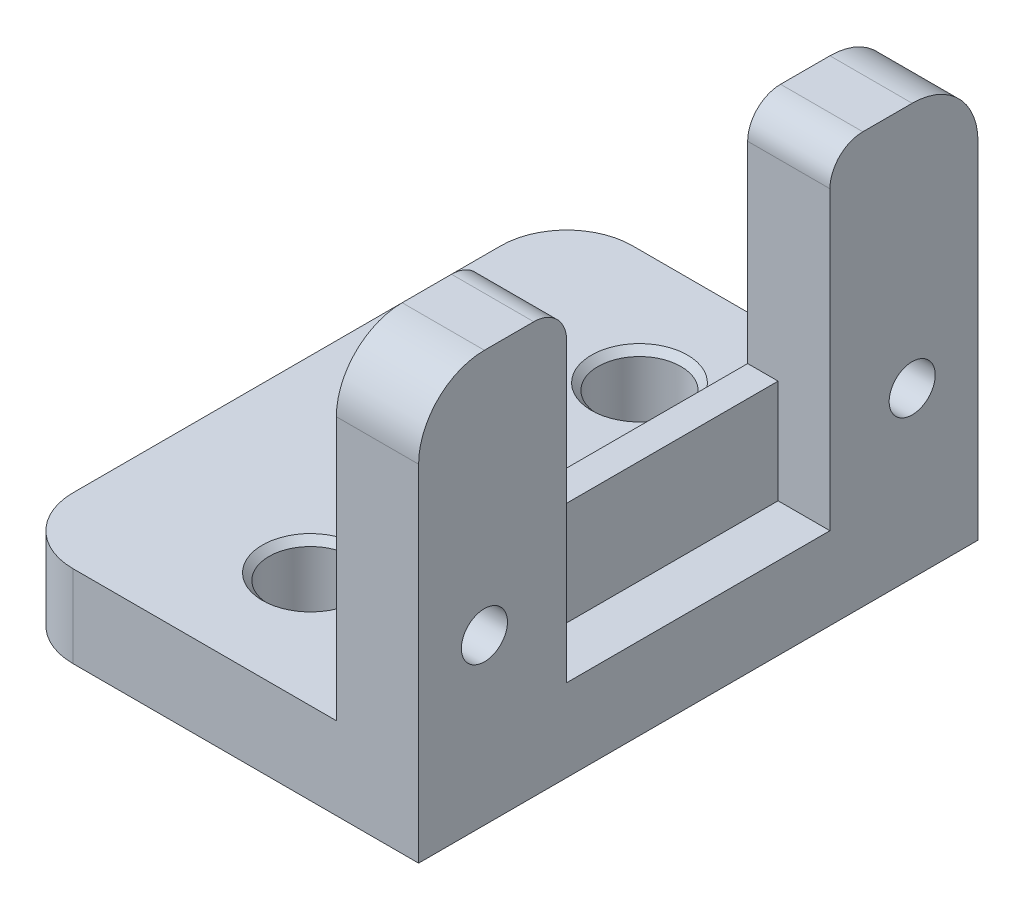
ISO-10303-21;
HEADER;
FILE_DESCRIPTION(('STEP AP214'),'2;1');
FILE_NAME('part.step','',(''),(''),'','','');
FILE_SCHEMA(('AUTOMOTIVE_DESIGN { 1 0 10303 214 1 1 1 1 }'));
ENDSEC;
DATA;
#1=APPLICATION_CONTEXT('core data for automotive mechanical design processes');
#2=APPLICATION_PROTOCOL_DEFINITION('international standard','automotive_design',2000,#1);
#3=PRODUCT_CONTEXT('',#1,'mechanical');
#4=PRODUCT('Part','Part','',(#3));
#5=PRODUCT_RELATED_PRODUCT_CATEGORY('part','',(#4));
#6=PRODUCT_DEFINITION_FORMATION('','',#4);
#7=PRODUCT_DEFINITION_CONTEXT('part definition',#1,'design');
#8=PRODUCT_DEFINITION('design','',#6,#7);
#9=PRODUCT_DEFINITION_SHAPE('','',#8);
#10=(LENGTH_UNIT() NAMED_UNIT(*) SI_UNIT(.MILLI.,.METRE.));
#11=(NAMED_UNIT(*) PLANE_ANGLE_UNIT() SI_UNIT($,.RADIAN.));
#12=(NAMED_UNIT(*) SI_UNIT($,.STERADIAN.) SOLID_ANGLE_UNIT());
#13=UNCERTAINTY_MEASURE_WITH_UNIT(LENGTH_MEASURE(1.E-05),#10,'distance_accuracy_value','');
#14=(GEOMETRIC_REPRESENTATION_CONTEXT(3) GLOBAL_UNCERTAINTY_ASSIGNED_CONTEXT((#13)) GLOBAL_UNIT_ASSIGNED_CONTEXT((#10,
#11,#12)) REPRESENTATION_CONTEXT('',''));
#15=CARTESIAN_POINT('',(0.,0.,0.));
#16=DIRECTION('',(0.,0.,1.));
#17=DIRECTION('',(1.,0.,0.));
#18=AXIS2_PLACEMENT_3D('',#15,#16,#17);
#19=CARTESIAN_POINT('',(-3.175,3.175,10.795));
#20=DIRECTION('',(0.,-1.,0.));
#21=DIRECTION('',(1.,0.,0.));
#22=AXIS2_PLACEMENT_3D('',#19,#20,#21);
#23=PLANE('',#22);
#24=CARTESIAN_POINT('',(-8.62,3.175,6.35));
#25=DIRECTION('',(0.,-1.,0.));
#26=DIRECTION('',(1.,0.,0.));
#27=AXIS2_PLACEMENT_3D('',#24,#25,#26);
#28=CIRCLE('',#27,1.85400000000001);
#29=CARTESIAN_POINT('',(-6.76599999999999,3.175,6.35));
#30=VERTEX_POINT('',#29);
#31=EDGE_CURVE('E270',#30,#30,#28,.T.);
#32=ORIENTED_EDGE('',*,*,#31,.T.);
#33=EDGE_LOOP('',(#32));
#34=FACE_BOUND('',#33,.T.);
#35=CARTESIAN_POINT('',(-8.62,3.175,-6.35));
#36=DIRECTION('',(0.,-1.,0.));
#37=DIRECTION('',(1.,0.,0.));
#38=AXIS2_PLACEMENT_3D('',#35,#36,#37);
#39=CIRCLE('',#38,1.85400000000001);
#40=CARTESIAN_POINT('',(-6.76599999999999,3.175,-6.35));
#41=VERTEX_POINT('',#40);
#42=EDGE_CURVE('E267',#41,#41,#39,.T.);
#43=ORIENTED_EDGE('',*,*,#42,.T.);
#44=EDGE_LOOP('',(#43));
#45=FACE_BOUND('',#44,.T.);
#46=DIRECTION('',(-1.,0.,0.));
#47=VECTOR('',#46,1.);
#48=CARTESIAN_POINT('',(-3.175,3.175,-10.795));
#49=LINE('',#48,#47);
#50=CARTESIAN_POINT('',(-3.175,3.175,-10.795));
#51=VERTEX_POINT('',#50);
#52=CARTESIAN_POINT('',(-13.335,3.175,-10.795));
#53=VERTEX_POINT('',#52);
#54=EDGE_CURVE('E223',#51,#53,#49,.T.);
#55=ORIENTED_EDGE('',*,*,#54,.T.);
#56=CARTESIAN_POINT('',(-13.335,3.175,-8.255));
#57=DIRECTION('',(0.,-1.,0.));
#58=DIRECTION('',(1.,0.,0.));
#59=AXIS2_PLACEMENT_3D('',#56,#57,#58);
#60=CIRCLE('',#59,2.54);
#61=CARTESIAN_POINT('',(-15.875,3.175,-8.255));
#62=VERTEX_POINT('',#61);
#63=EDGE_CURVE('E311',#53,#62,#60,.F.);
#64=ORIENTED_EDGE('',*,*,#63,.T.);
#65=DIRECTION('',(0.,0.,-1.));
#66=VECTOR('',#65,1.);
#67=CARTESIAN_POINT('',(-15.875,3.175,10.795));
#68=LINE('',#67,#66);
#69=CARTESIAN_POINT('',(-15.875,3.175,8.255));
#70=VERTEX_POINT('',#69);
#71=EDGE_CURVE('E231',#70,#62,#68,.T.);
#72=ORIENTED_EDGE('',*,*,#71,.F.);
#73=CARTESIAN_POINT('',(-13.335,3.175,8.255));
#74=DIRECTION('',(0.,-1.,0.));
#75=DIRECTION('',(1.,0.,0.));
#76=AXIS2_PLACEMENT_3D('',#73,#74,#75);
#77=CIRCLE('',#76,2.54);
#78=CARTESIAN_POINT('',(-13.335,3.175,10.795));
#79=VERTEX_POINT('',#78);
#80=EDGE_CURVE('E309',#70,#79,#77,.F.);
#81=ORIENTED_EDGE('',*,*,#80,.T.);
#82=DIRECTION('',(-1.,0.,0.));
#83=VECTOR('',#82,1.);
#84=CARTESIAN_POINT('',(-3.175,3.175,10.795));
#85=LINE('',#84,#83);
#86=CARTESIAN_POINT('',(-3.175,3.175,10.795));
#87=VERTEX_POINT('',#86);
#88=EDGE_CURVE('E228',#87,#79,#85,.T.);
#89=ORIENTED_EDGE('',*,*,#88,.F.);
#90=DIRECTION('',(0.,0.,-1.));
#91=VECTOR('',#90,1.);
#92=CARTESIAN_POINT('',(-3.175,3.175,10.795));
#93=LINE('',#92,#91);
#94=EDGE_CURVE('E244',#87,#51,#93,.T.);
#95=ORIENTED_EDGE('',*,*,#94,.T.);
#96=EDGE_LOOP('',(#55,#64,#72,#81,#89,#95));
#97=FACE_BOUND('',#96,.T.);
#98=ADVANCED_FACE('F38',(#34,#45,#97),#23,.F.);
#99=DIRECTION('',(0.,0.,-1.));
#100=VECTOR('',#99,1.);
#101=CARTESIAN_POINT('',(-2.,3.175,5.08));
#102=LINE('',#101,#100);
#103=CARTESIAN_POINT('',(-2.,3.175,5.08));
#104=VERTEX_POINT('',#103);
#105=CARTESIAN_POINT('',(-2.,3.175,-5.08));
#106=VERTEX_POINT('',#105);
#107=EDGE_CURVE('E184',#104,#106,#102,.T.);
#108=ORIENTED_EDGE('',*,*,#107,.F.);
#109=DIRECTION('',(1.,0.,0.));
#110=VECTOR('',#109,1.);
#111=CARTESIAN_POINT('',(-15.875,3.175,5.08));
#112=LINE('',#111,#110);
#113=CARTESIAN_POINT('',(0.,3.175,5.08));
#114=VERTEX_POINT('',#113);
#115=EDGE_CURVE('E214',#104,#114,#112,.T.);
#116=ORIENTED_EDGE('',*,*,#115,.T.);
#117=DIRECTION('',(0.,0.,-1.));
#118=VECTOR('',#117,1.);
#119=CARTESIAN_POINT('',(0.,3.175,5.08));
#120=LINE('',#119,#118);
#121=CARTESIAN_POINT('',(0.,3.175,-5.08));
#122=VERTEX_POINT('',#121);
#123=EDGE_CURVE('E209',#114,#122,#120,.T.);
#124=ORIENTED_EDGE('',*,*,#123,.T.);
#125=DIRECTION('',(1.,0.,0.));
#126=VECTOR('',#125,1.);
#127=CARTESIAN_POINT('',(-15.875,3.175,-5.08));
#128=LINE('',#127,#126);
#129=EDGE_CURVE('E207',#106,#122,#128,.T.);
#130=ORIENTED_EDGE('',*,*,#129,.F.);
#131=EDGE_LOOP('',(#108,#116,#124,#130));
#132=FACE_BOUND('',#131,.T.);
#133=ADVANCED_FACE('F392',(#132),#23,.F.);
#134=CARTESIAN_POINT('',(-15.875,15.875,5.08));
#135=DIRECTION('',(0.,0.,1.));
#136=DIRECTION('',(0.,-1.,0.));
#137=AXIS2_PLACEMENT_3D('',#134,#135,#136);
#138=PLANE('',#137);
#139=DIRECTION('',(0.,-1.,0.));
#140=VECTOR('',#139,1.);
#141=CARTESIAN_POINT('',(-3.175,15.875,5.08));
#142=LINE('',#141,#140);
#143=CARTESIAN_POINT('',(-3.175,14.605,5.08));
#144=VERTEX_POINT('',#143);
#145=CARTESIAN_POINT('',(-3.175,7.175,5.08));
#146=VERTEX_POINT('',#145);
#147=EDGE_CURVE('E165',#144,#146,#142,.T.);
#148=ORIENTED_EDGE('',*,*,#147,.F.);
#149=DIRECTION('',(1.,0.,0.));
#150=VECTOR('',#149,1.);
#151=CARTESIAN_POINT('',(-15.875,14.605,5.08));
#152=LINE('',#151,#150);
#153=CARTESIAN_POINT('',(0.,14.605,5.08));
#154=VERTEX_POINT('',#153);
#155=EDGE_CURVE('E313',#144,#154,#152,.T.);
#156=ORIENTED_EDGE('',*,*,#155,.T.);
#157=DIRECTION('',(0.,-1.,0.));
#158=VECTOR('',#157,1.);
#159=CARTESIAN_POINT('',(0.,15.875,5.08));
#160=LINE('',#159,#158);
#161=EDGE_CURVE('E199',#154,#114,#160,.T.);
#162=ORIENTED_EDGE('',*,*,#161,.T.);
#163=ORIENTED_EDGE('',*,*,#115,.F.);
#164=DIRECTION('',(0.,-1.,0.));
#165=VECTOR('',#164,1.);
#166=CARTESIAN_POINT('',(-2.,7.175,5.08));
#167=LINE('',#166,#165);
#168=CARTESIAN_POINT('',(-2.,7.175,5.08));
#169=VERTEX_POINT('',#168);
#170=EDGE_CURVE('E192',#169,#104,#167,.T.);
#171=ORIENTED_EDGE('',*,*,#170,.F.);
#172=DIRECTION('',(1.,0.,0.));
#173=VECTOR('',#172,1.);
#174=CARTESIAN_POINT('',(-3.175,7.175,5.08));
#175=LINE('',#174,#173);
#176=EDGE_CURVE('E183',#146,#169,#175,.T.);
#177=ORIENTED_EDGE('',*,*,#176,.F.);
#178=EDGE_LOOP('',(#148,#156,#162,#163,#171,#177));
#179=FACE_BOUND('',#178,.T.);
#180=ADVANCED_FACE('F386',(#179),#138,.F.);
#181=CARTESIAN_POINT('',(-15.875,15.875,-5.08));
#182=DIRECTION('',(0.,0.,-1.));
#183=DIRECTION('',(0.,1.,0.));
#184=AXIS2_PLACEMENT_3D('',#181,#182,#183);
#185=PLANE('',#184);
#186=DIRECTION('',(0.,1.,0.));
#187=VECTOR('',#186,1.);
#188=CARTESIAN_POINT('',(0.,15.875,-5.08));
#189=LINE('',#188,#187);
#190=CARTESIAN_POINT('',(0.,14.605,-5.08));
#191=VERTEX_POINT('',#190);
#192=EDGE_CURVE('E212',#122,#191,#189,.T.);
#193=ORIENTED_EDGE('',*,*,#192,.T.);
#194=DIRECTION('',(1.,0.,0.));
#195=VECTOR('',#194,1.);
#196=CARTESIAN_POINT('',(-15.875,14.605,-5.08));
#197=LINE('',#196,#195);
#198=CARTESIAN_POINT('',(-3.175,14.605,-5.08));
#199=VERTEX_POINT('',#198);
#200=EDGE_CURVE('E11',#191,#199,#197,.F.);
#201=ORIENTED_EDGE('',*,*,#200,.T.);
#202=DIRECTION('',(0.,1.,0.));
#203=VECTOR('',#202,1.);
#204=CARTESIAN_POINT('',(-3.175,15.875,-5.08));
#205=LINE('',#204,#203);
#206=CARTESIAN_POINT('',(-3.175,7.175,-5.08));
#207=VERTEX_POINT('',#206);
#208=EDGE_CURVE('E159',#207,#199,#205,.T.);
#209=ORIENTED_EDGE('',*,*,#208,.F.);
#210=DIRECTION('',(-1.,0.,0.));
#211=VECTOR('',#210,1.);
#212=CARTESIAN_POINT('',(-3.175,7.175,-5.08));
#213=LINE('',#212,#211);
#214=CARTESIAN_POINT('',(-2.,7.175,-5.08));
#215=VERTEX_POINT('',#214);
#216=EDGE_CURVE('E162',#215,#207,#213,.T.);
#217=ORIENTED_EDGE('',*,*,#216,.F.);
#218=DIRECTION('',(0.,-1.,0.));
#219=VECTOR('',#218,1.);
#220=CARTESIAN_POINT('',(-2.,7.175,-5.08));
#221=LINE('',#220,#219);
#222=EDGE_CURVE('E176',#215,#106,#221,.T.);
#223=ORIENTED_EDGE('',*,*,#222,.T.);
#224=ORIENTED_EDGE('',*,*,#129,.T.);
#225=EDGE_LOOP('',(#193,#201,#209,#217,#223,#224));
#226=FACE_BOUND('',#225,.T.);
#227=ADVANCED_FACE('F161',(#226),#185,.F.);
#228=CARTESIAN_POINT('',(0.,15.875,10.795));
#229=DIRECTION('',(0.,-1.,0.));
#230=DIRECTION('',(0.,0.,-1.));
#231=AXIS2_PLACEMENT_3D('',#228,#229,#230);
#232=PLANE('',#231);
#233=DIRECTION('',(0.,0.,-1.));
#234=VECTOR('',#233,1.);
#235=CARTESIAN_POINT('',(0.,15.875,10.795));
#236=LINE('',#235,#234);
#237=CARTESIAN_POINT('',(0.,15.875,8.255));
#238=VERTEX_POINT('',#237);
#239=CARTESIAN_POINT('',(0.,15.875,6.35));
#240=VERTEX_POINT('',#239);
#241=EDGE_CURVE('E251',#238,#240,#236,.T.);
#242=ORIENTED_EDGE('',*,*,#241,.T.);
#243=DIRECTION('',(1.,0.,0.));
#244=VECTOR('',#243,1.);
#245=CARTESIAN_POINT('',(0.,15.875,6.35));
#246=LINE('',#245,#244);
#247=CARTESIAN_POINT('',(-3.175,15.875,6.35));
#248=VERTEX_POINT('',#247);
#249=EDGE_CURVE('E320',#240,#248,#246,.F.);
#250=ORIENTED_EDGE('',*,*,#249,.T.);
#251=DIRECTION('',(0.,0.,-1.));
#252=VECTOR('',#251,1.);
#253=CARTESIAN_POINT('',(-3.175,15.875,10.795));
#254=LINE('',#253,#252);
#255=CARTESIAN_POINT('',(-3.175,15.875,8.255));
#256=VERTEX_POINT('',#255);
#257=EDGE_CURVE('E248',#256,#248,#254,.T.);
#258=ORIENTED_EDGE('',*,*,#257,.F.);
#259=DIRECTION('',(-1.,0.,0.));
#260=VECTOR('',#259,1.);
#261=CARTESIAN_POINT('',(0.,15.875,8.255));
#262=LINE('',#261,#260);
#263=EDGE_CURVE('E298',#256,#238,#262,.F.);
#264=ORIENTED_EDGE('',*,*,#263,.T.);
#265=EDGE_LOOP('',(#242,#250,#258,#264));
#266=FACE_BOUND('',#265,.T.);
#267=ADVANCED_FACE('F376',(#266),#232,.F.);
#268=CARTESIAN_POINT('',(-15.875,3.175,10.795));
#269=DIRECTION('',(1.,0.,0.));
#270=DIRECTION('',(0.,0.,-1.));
#271=AXIS2_PLACEMENT_3D('',#268,#269,#270);
#272=PLANE('',#271);
#273=ORIENTED_EDGE('',*,*,#71,.T.);
#274=DIRECTION('',(0.,-1.,0.));
#275=VECTOR('',#274,1.);
#276=CARTESIAN_POINT('',(-15.875,3.175,-8.255));
#277=LINE('',#276,#275);
#278=CARTESIAN_POINT('',(-15.875,0.,-8.255));
#279=VERTEX_POINT('',#278);
#280=EDGE_CURVE('E302',#62,#279,#277,.T.);
#281=ORIENTED_EDGE('',*,*,#280,.T.);
#282=DIRECTION('',(0.,0.,-1.));
#283=VECTOR('',#282,1.);
#284=CARTESIAN_POINT('',(-15.875,0.,10.795));
#285=LINE('',#284,#283);
#286=CARTESIAN_POINT('',(-15.875,0.,8.255));
#287=VERTEX_POINT('',#286);
#288=EDGE_CURVE('E257',#287,#279,#285,.T.);
#289=ORIENTED_EDGE('',*,*,#288,.F.);
#290=DIRECTION('',(0.,-1.,0.));
#291=VECTOR('',#290,1.);
#292=CARTESIAN_POINT('',(-15.875,3.175,8.255));
#293=LINE('',#292,#291);
#294=EDGE_CURVE('E300',#287,#70,#293,.F.);
#295=ORIENTED_EDGE('',*,*,#294,.T.);
#296=EDGE_LOOP('',(#273,#281,#289,#295));
#297=FACE_BOUND('',#296,.T.);
#298=ADVANCED_FACE('F357',(#297),#272,.F.);
#299=CARTESIAN_POINT('',(-15.875,0.,10.795));
#300=DIRECTION('',(0.,1.,0.));
#301=DIRECTION('',(0.,0.,1.));
#302=AXIS2_PLACEMENT_3D('',#299,#300,#301);
#303=PLANE('',#302);
#304=CARTESIAN_POINT('',(-8.62,0.,-6.35));
#305=DIRECTION('',(0.,1.,0.));
#306=DIRECTION('',(-1.,0.,0.));
#307=AXIS2_PLACEMENT_3D('',#304,#305,#306);
#308=CIRCLE('',#307,1.6);
#309=CARTESIAN_POINT('',(-10.22,0.,-6.35));
#310=VERTEX_POINT('',#309);
#311=EDGE_CURVE('E196',#310,#310,#308,.T.);
#312=ORIENTED_EDGE('',*,*,#311,.T.);
#313=EDGE_LOOP('',(#312));
#314=FACE_BOUND('',#313,.T.);
#315=CARTESIAN_POINT('',(-8.62,0.,6.35));
#316=DIRECTION('',(0.,1.,0.));
#317=DIRECTION('',(-1.,0.,0.));
#318=AXIS2_PLACEMENT_3D('',#315,#316,#317);
#319=CIRCLE('',#318,1.6);
#320=CARTESIAN_POINT('',(-10.22,0.,6.35));
#321=VERTEX_POINT('',#320);
#322=EDGE_CURVE('E195',#321,#321,#319,.T.);
#323=ORIENTED_EDGE('',*,*,#322,.T.);
#324=EDGE_LOOP('',(#323));
#325=FACE_BOUND('',#324,.T.);
#326=ORIENTED_EDGE('',*,*,#288,.T.);
#327=CARTESIAN_POINT('',(-13.335,0.,-8.255));
#328=DIRECTION('',(0.,1.,0.));
#329=DIRECTION('',(0.,0.,1.));
#330=AXIS2_PLACEMENT_3D('',#327,#328,#329);
#331=CIRCLE('',#330,2.54);
#332=CARTESIAN_POINT('',(-13.335,0.,-10.795));
#333=VERTEX_POINT('',#332);
#334=EDGE_CURVE('E307',#279,#333,#331,.F.);
#335=ORIENTED_EDGE('',*,*,#334,.T.);
#336=DIRECTION('',(1.,0.,0.));
#337=VECTOR('',#336,1.);
#338=CARTESIAN_POINT('',(-15.875,0.,-10.795));
#339=LINE('',#338,#337);
#340=CARTESIAN_POINT('',(0.,0.,-10.795));
#341=VERTEX_POINT('',#340);
#342=EDGE_CURVE('E232',#333,#341,#339,.T.);
#343=ORIENTED_EDGE('',*,*,#342,.T.);
#344=DIRECTION('',(0.,0.,-1.));
#345=VECTOR('',#344,1.);
#346=CARTESIAN_POINT('',(0.,0.,10.795));
#347=LINE('',#346,#345);
#348=CARTESIAN_POINT('',(0.,0.,10.795));
#349=VERTEX_POINT('',#348);
#350=EDGE_CURVE('E254',#349,#341,#347,.T.);
#351=ORIENTED_EDGE('',*,*,#350,.F.);
#352=DIRECTION('',(1.,0.,0.));
#353=VECTOR('',#352,1.);
#354=CARTESIAN_POINT('',(-15.875,0.,10.795));
#355=LINE('',#354,#353);
#356=CARTESIAN_POINT('',(-13.335,0.,10.795));
#357=VERTEX_POINT('',#356);
#358=EDGE_CURVE('E220',#357,#349,#355,.T.);
#359=ORIENTED_EDGE('',*,*,#358,.F.);
#360=CARTESIAN_POINT('',(-13.335,0.,8.255));
#361=DIRECTION('',(0.,1.,0.));
#362=DIRECTION('',(0.,0.,1.));
#363=AXIS2_PLACEMENT_3D('',#360,#361,#362);
#364=CIRCLE('',#363,2.54);
#365=EDGE_CURVE('E305',#357,#287,#364,.F.);
#366=ORIENTED_EDGE('',*,*,#365,.T.);
#367=EDGE_LOOP('',(#326,#335,#343,#351,#359,#366));
#368=FACE_BOUND('',#367,.T.);
#369=ADVANCED_FACE('F360',(#314,#325,#368),#303,.F.);
#370=CARTESIAN_POINT('',(0.,0.,10.795));
#371=DIRECTION('',(-1.,0.,0.));
#372=DIRECTION('',(0.,0.,1.));
#373=AXIS2_PLACEMENT_3D('',#370,#371,#372);
#374=PLANE('',#373);
#375=CARTESIAN_POINT('',(0.,6.35,8.255));
#376=DIRECTION('',(1.,0.,0.));
#377=DIRECTION('',(0.,0.,-1.));
#378=AXIS2_PLACEMENT_3D('',#375,#376,#377);
#379=CIRCLE('',#378,0.888999999999999);
#380=CARTESIAN_POINT('',(0.,6.35,7.366));
#381=VERTEX_POINT('',#380);
#382=EDGE_CURVE('E166',#381,#381,#379,.T.);
#383=ORIENTED_EDGE('',*,*,#382,.F.);
#384=EDGE_LOOP('',(#383));
#385=FACE_BOUND('',#384,.T.);
#386=CARTESIAN_POINT('',(0.,6.35,-8.255));
#387=DIRECTION('',(1.,0.,0.));
#388=DIRECTION('',(0.,0.,1.));
#389=AXIS2_PLACEMENT_3D('',#386,#387,#388);
#390=CIRCLE('',#389,0.889);
#391=CARTESIAN_POINT('',(0.,6.35,-7.366));
#392=VERTEX_POINT('',#391);
#393=EDGE_CURVE('E204',#392,#392,#390,.T.);
#394=ORIENTED_EDGE('',*,*,#393,.F.);
#395=EDGE_LOOP('',(#394));
#396=FACE_BOUND('',#395,.T.);
#397=ORIENTED_EDGE('',*,*,#161,.F.);
#398=CARTESIAN_POINT('',(0.,14.605,6.35));
#399=DIRECTION('',(-1.,0.,0.));
#400=DIRECTION('',(0.,0.,1.));
#401=AXIS2_PLACEMENT_3D('',#398,#399,#400);
#402=CIRCLE('',#401,1.27);
#403=EDGE_CURVE('E318',#154,#240,#402,.F.);
#404=ORIENTED_EDGE('',*,*,#403,.T.);
#405=ORIENTED_EDGE('',*,*,#241,.F.);
#406=CARTESIAN_POINT('',(0.,13.335,8.255));
#407=DIRECTION('',(-1.,0.,0.));
#408=DIRECTION('',(0.,0.,1.));
#409=AXIS2_PLACEMENT_3D('',#406,#407,#408);
#410=CIRCLE('',#409,2.54);
#411=CARTESIAN_POINT('',(0.,13.335,10.795));
#412=VERTEX_POINT('',#411);
#413=EDGE_CURVE('E287',#238,#412,#410,.F.);
#414=ORIENTED_EDGE('',*,*,#413,.T.);
#415=DIRECTION('',(0.,1.,0.));
#416=VECTOR('',#415,1.);
#417=CARTESIAN_POINT('',(0.,0.,10.795));
#418=LINE('',#417,#416);
#419=EDGE_CURVE('E222',#349,#412,#418,.T.);
#420=ORIENTED_EDGE('',*,*,#419,.F.);
#421=ORIENTED_EDGE('',*,*,#350,.T.);
#422=DIRECTION('',(0.,1.,0.));
#423=VECTOR('',#422,1.);
#424=CARTESIAN_POINT('',(0.,0.,-10.795));
#425=LINE('',#424,#423);
#426=CARTESIAN_POINT('',(0.,13.335,-10.795));
#427=VERTEX_POINT('',#426);
#428=EDGE_CURVE('E234',#341,#427,#425,.T.);
#429=ORIENTED_EDGE('',*,*,#428,.T.);
#430=CARTESIAN_POINT('',(0.,13.335,-8.255));
#431=DIRECTION('',(-1.,0.,0.));
#432=DIRECTION('',(0.,0.,1.));
#433=AXIS2_PLACEMENT_3D('',#430,#431,#432);
#434=CIRCLE('',#433,2.54);
#435=CARTESIAN_POINT('',(0.,15.875,-8.255));
#436=VERTEX_POINT('',#435);
#437=EDGE_CURVE('E289',#427,#436,#434,.F.);
#438=ORIENTED_EDGE('',*,*,#437,.T.);
#439=CARTESIAN_POINT('',(0.,15.875,-6.35));
#440=VERTEX_POINT('',#439);
#441=EDGE_CURVE('E250',#440,#436,#236,.T.);
#442=ORIENTED_EDGE('',*,*,#441,.F.);
#443=CARTESIAN_POINT('',(0.,14.605,-6.35));
#444=DIRECTION('',(-1.,0.,0.));
#445=DIRECTION('',(0.,0.,1.));
#446=AXIS2_PLACEMENT_3D('',#443,#444,#445);
#447=CIRCLE('',#446,1.27);
#448=EDGE_CURVE('E316',#440,#191,#447,.F.);
#449=ORIENTED_EDGE('',*,*,#448,.T.);
#450=ORIENTED_EDGE('',*,*,#192,.F.);
#451=ORIENTED_EDGE('',*,*,#123,.F.);
#452=EDGE_LOOP('',(#397,#404,#405,#414,#420,#421,#429,#438,#442,#449,#450,#451));
#453=FACE_BOUND('',#452,.T.);
#454=ADVANCED_FACE('F332',(#385,#396,#453),#374,.F.);
#455=CARTESIAN_POINT('',(-3.175,15.875,-6.35));
#456=VERTEX_POINT('',#455);
#457=CARTESIAN_POINT('',(-3.175,15.875,-8.255));
#458=VERTEX_POINT('',#457);
#459=EDGE_CURVE('E247',#456,#458,#254,.T.);
#460=ORIENTED_EDGE('',*,*,#459,.F.);
#461=DIRECTION('',(1.,0.,0.));
#462=VECTOR('',#461,1.);
#463=CARTESIAN_POINT('',(0.,15.875,-6.35));
#464=LINE('',#463,#462);
#465=EDGE_CURVE('E46',#456,#440,#464,.T.);
#466=ORIENTED_EDGE('',*,*,#465,.T.);
#467=ORIENTED_EDGE('',*,*,#441,.T.);
#468=DIRECTION('',(-1.,0.,0.));
#469=VECTOR('',#468,1.);
#470=CARTESIAN_POINT('',(0.,15.875,-8.255));
#471=LINE('',#470,#469);
#472=EDGE_CURVE('E276',#436,#458,#471,.T.);
#473=ORIENTED_EDGE('',*,*,#472,.T.);
#474=EDGE_LOOP('',(#460,#466,#467,#473));
#475=FACE_BOUND('',#474,.T.);
#476=ADVANCED_FACE('F328',(#475),#232,.F.);
#477=CARTESIAN_POINT('',(-3.175,15.875,10.795));
#478=DIRECTION('',(1.,0.,0.));
#479=DIRECTION('',(0.,1.,0.));
#480=AXIS2_PLACEMENT_3D('',#477,#478,#479);
#481=PLANE('',#480);
#482=CARTESIAN_POINT('',(-3.175,6.35,-8.255));
#483=DIRECTION('',(1.,0.,0.));
#484=DIRECTION('',(0.,1.,0.));
#485=AXIS2_PLACEMENT_3D('',#482,#483,#484);
#486=CIRCLE('',#485,0.889);
#487=CARTESIAN_POINT('',(-3.175,7.239,-8.255));
#488=VERTEX_POINT('',#487);
#489=EDGE_CURVE('E219',#488,#488,#486,.T.);
#490=ORIENTED_EDGE('',*,*,#489,.T.);
#491=EDGE_LOOP('',(#490));
#492=FACE_BOUND('',#491,.T.);
#493=ORIENTED_EDGE('',*,*,#257,.T.);
#494=CARTESIAN_POINT('',(-3.175,14.605,6.35));
#495=DIRECTION('',(1.,0.,0.));
#496=DIRECTION('',(0.,1.,0.));
#497=AXIS2_PLACEMENT_3D('',#494,#495,#496);
#498=CIRCLE('',#497,1.27);
#499=EDGE_CURVE('E323',#248,#144,#498,.F.);
#500=ORIENTED_EDGE('',*,*,#499,.T.);
#501=ORIENTED_EDGE('',*,*,#147,.T.);
#502=DIRECTION('',(0.,0.,1.));
#503=VECTOR('',#502,1.);
#504=CARTESIAN_POINT('',(-3.175,7.175,5.08));
#505=LINE('',#504,#503);
#506=EDGE_CURVE('E172',#207,#146,#505,.T.);
#507=ORIENTED_EDGE('',*,*,#506,.F.);
#508=ORIENTED_EDGE('',*,*,#208,.T.);
#509=CARTESIAN_POINT('',(-3.175,14.605,-6.35));
#510=DIRECTION('',(1.,0.,0.));
#511=DIRECTION('',(0.,1.,0.));
#512=AXIS2_PLACEMENT_3D('',#509,#510,#511);
#513=CIRCLE('',#512,1.27);
#514=EDGE_CURVE('E58',#199,#456,#513,.F.);
#515=ORIENTED_EDGE('',*,*,#514,.T.);
#516=ORIENTED_EDGE('',*,*,#459,.T.);
#517=CARTESIAN_POINT('',(-3.175,13.335,-8.255));
#518=DIRECTION('',(1.,0.,0.));
#519=DIRECTION('',(0.,1.,0.));
#520=AXIS2_PLACEMENT_3D('',#517,#518,#519);
#521=CIRCLE('',#520,2.54);
#522=CARTESIAN_POINT('',(-3.175,13.335,-10.795));
#523=VERTEX_POINT('',#522);
#524=EDGE_CURVE('E281',#458,#523,#521,.F.);
#525=ORIENTED_EDGE('',*,*,#524,.T.);
#526=DIRECTION('',(0.,-1.,0.));
#527=VECTOR('',#526,1.);
#528=CARTESIAN_POINT('',(-3.175,15.875,-10.795));
#529=LINE('',#528,#527);
#530=EDGE_CURVE('E238',#523,#51,#529,.T.);
#531=ORIENTED_EDGE('',*,*,#530,.T.);
#532=ORIENTED_EDGE('',*,*,#94,.F.);
#533=DIRECTION('',(0.,-1.,0.));
#534=VECTOR('',#533,1.);
#535=CARTESIAN_POINT('',(-3.175,15.875,10.795));
#536=LINE('',#535,#534);
#537=CARTESIAN_POINT('',(-3.175,13.335,10.795));
#538=VERTEX_POINT('',#537);
#539=EDGE_CURVE('E226',#538,#87,#536,.T.);
#540=ORIENTED_EDGE('',*,*,#539,.F.);
#541=CARTESIAN_POINT('',(-3.175,13.335,8.255));
#542=DIRECTION('',(1.,0.,0.));
#543=DIRECTION('',(0.,1.,0.));
#544=AXIS2_PLACEMENT_3D('',#541,#542,#543);
#545=CIRCLE('',#544,2.54);
#546=EDGE_CURVE('E279',#538,#256,#545,.F.);
#547=ORIENTED_EDGE('',*,*,#546,.T.);
#548=EDGE_LOOP('',(#493,#500,#501,#507,#508,#515,#516,#525,#531,#532,#540,#547));
#549=FACE_BOUND('',#548,.T.);
#550=CARTESIAN_POINT('',(-3.175,6.35,8.255));
#551=DIRECTION('',(1.,0.,0.));
#552=DIRECTION('',(0.,1.,0.));
#553=AXIS2_PLACEMENT_3D('',#550,#551,#552);
#554=CIRCLE('',#553,0.888999999999999);
#555=CARTESIAN_POINT('',(-3.175,7.239,8.255));
#556=VERTEX_POINT('',#555);
#557=EDGE_CURVE('E235',#556,#556,#554,.T.);
#558=ORIENTED_EDGE('',*,*,#557,.T.);
#559=EDGE_LOOP('',(#558));
#560=FACE_BOUND('',#559,.T.);
#561=ADVANCED_FACE('F179',(#492,#549,#560),#481,.F.);
#562=CARTESIAN_POINT('',(0.,0.,10.795));
#563=DIRECTION('',(0.,0.,1.));
#564=DIRECTION('',(1.,0.,0.));
#565=AXIS2_PLACEMENT_3D('',#562,#563,#564);
#566=PLANE('',#565);
#567=ORIENTED_EDGE('',*,*,#419,.T.);
#568=DIRECTION('',(-1.,0.,0.));
#569=VECTOR('',#568,1.);
#570=CARTESIAN_POINT('',(-3.175,13.335,10.795));
#571=LINE('',#570,#569);
#572=EDGE_CURVE('E295',#412,#538,#571,.T.);
#573=ORIENTED_EDGE('',*,*,#572,.T.);
#574=ORIENTED_EDGE('',*,*,#539,.T.);
#575=ORIENTED_EDGE('',*,*,#88,.T.);
#576=DIRECTION('',(0.,-1.,0.));
#577=VECTOR('',#576,1.);
#578=CARTESIAN_POINT('',(-13.335,0.,10.795));
#579=LINE('',#578,#577);
#580=EDGE_CURVE('E292',#79,#357,#579,.T.);
#581=ORIENTED_EDGE('',*,*,#580,.T.);
#582=ORIENTED_EDGE('',*,*,#358,.T.);
#583=EDGE_LOOP('',(#567,#573,#574,#575,#581,#582));
#584=FACE_BOUND('',#583,.T.);
#585=ADVANCED_FACE('F368',(#584),#566,.T.);
#586=CARTESIAN_POINT('',(0.,0.,-10.795));
#587=DIRECTION('',(0.,0.,1.));
#588=DIRECTION('',(1.,0.,0.));
#589=AXIS2_PLACEMENT_3D('',#586,#587,#588);
#590=PLANE('',#589);
#591=ORIENTED_EDGE('',*,*,#530,.F.);
#592=DIRECTION('',(-1.,0.,0.));
#593=VECTOR('',#592,1.);
#594=CARTESIAN_POINT('',(0.,13.335,-10.795));
#595=LINE('',#594,#593);
#596=EDGE_CURVE('E285',#523,#427,#595,.F.);
#597=ORIENTED_EDGE('',*,*,#596,.T.);
#598=ORIENTED_EDGE('',*,*,#428,.F.);
#599=ORIENTED_EDGE('',*,*,#342,.F.);
#600=DIRECTION('',(0.,-1.,0.));
#601=VECTOR('',#600,1.);
#602=CARTESIAN_POINT('',(-13.335,0.,-10.795));
#603=LINE('',#602,#601);
#604=EDGE_CURVE('E283',#333,#53,#603,.F.);
#605=ORIENTED_EDGE('',*,*,#604,.T.);
#606=ORIENTED_EDGE('',*,*,#54,.F.);
#607=EDGE_LOOP('',(#591,#597,#598,#599,#605,#606));
#608=FACE_BOUND('',#607,.T.);
#609=ADVANCED_FACE('F345',(#608),#590,.F.);
#610=CARTESIAN_POINT('',(-15.875,6.35,-8.255));
#611=DIRECTION('',(1.,0.,0.));
#612=DIRECTION('',(0.,0.,-1.));
#613=AXIS2_PLACEMENT_3D('',#610,#611,#612);
#614=CYLINDRICAL_SURFACE('',#613,0.889);
#615=ORIENTED_EDGE('',*,*,#393,.T.);
#616=EDGE_LOOP('',(#615));
#617=FACE_BOUND('',#616,.T.);
#618=ORIENTED_EDGE('',*,*,#489,.F.);
#619=EDGE_LOOP('',(#618));
#620=FACE_BOUND('',#619,.T.);
#621=ADVANCED_FACE('F586',(#617,#620),#614,.F.);
#622=CARTESIAN_POINT('',(-15.875,6.35,8.255));
#623=DIRECTION('',(1.,0.,0.));
#624=DIRECTION('',(0.,0.,-1.));
#625=AXIS2_PLACEMENT_3D('',#622,#623,#624);
#626=CYLINDRICAL_SURFACE('',#625,0.888999999999999);
#627=ORIENTED_EDGE('',*,*,#382,.T.);
#628=EDGE_LOOP('',(#627));
#629=FACE_BOUND('',#628,.T.);
#630=ORIENTED_EDGE('',*,*,#557,.F.);
#631=EDGE_LOOP('',(#630));
#632=FACE_BOUND('',#631,.T.);
#633=ADVANCED_FACE('F511',(#629,#632),#626,.F.);
#634=CARTESIAN_POINT('',(-8.62,0.,6.35));
#635=DIRECTION('',(0.,1.,0.));
#636=DIRECTION('',(-1.,0.,0.));
#637=AXIS2_PLACEMENT_3D('',#634,#635,#636);
#638=CYLINDRICAL_SURFACE('',#637,1.6);
#639=CARTESIAN_POINT('',(-8.62,2.92099999999999,6.35));
#640=DIRECTION('',(0.,-1.,0.));
#641=DIRECTION('',(0.,0.,-1.));
#642=AXIS2_PLACEMENT_3D('',#639,#640,#641);
#643=CIRCLE('',#642,1.6);
#644=CARTESIAN_POINT('',(-8.62,2.92099999999999,4.75));
#645=VERTEX_POINT('',#644);
#646=EDGE_CURVE('E260',#645,#645,#643,.F.);
#647=ORIENTED_EDGE('',*,*,#646,.T.);
#648=EDGE_LOOP('',(#647));
#649=FACE_BOUND('',#648,.T.);
#650=ORIENTED_EDGE('',*,*,#322,.F.);
#651=EDGE_LOOP('',(#650));
#652=FACE_BOUND('',#651,.T.);
#653=ADVANCED_FACE('F534',(#649,#652),#638,.F.);
#654=CARTESIAN_POINT('',(-8.62,0.,-6.35));
#655=DIRECTION('',(0.,1.,0.));
#656=DIRECTION('',(-1.,0.,0.));
#657=AXIS2_PLACEMENT_3D('',#654,#655,#656);
#658=CYLINDRICAL_SURFACE('',#657,1.6);
#659=CARTESIAN_POINT('',(-8.62,2.92099999999999,-6.35));
#660=DIRECTION('',(0.,-1.,0.));
#661=DIRECTION('',(0.,0.,-1.));
#662=AXIS2_PLACEMENT_3D('',#659,#660,#661);
#663=CIRCLE('',#662,1.6);
#664=CARTESIAN_POINT('',(-8.62,2.92099999999999,-7.95));
#665=VERTEX_POINT('',#664);
#666=EDGE_CURVE('E273',#665,#665,#663,.F.);
#667=ORIENTED_EDGE('',*,*,#666,.T.);
#668=EDGE_LOOP('',(#667));
#669=FACE_BOUND('',#668,.T.);
#670=ORIENTED_EDGE('',*,*,#311,.F.);
#671=EDGE_LOOP('',(#670));
#672=FACE_BOUND('',#671,.T.);
#673=ADVANCED_FACE('F519',(#669,#672),#658,.F.);
#674=CARTESIAN_POINT('',(-2.,7.175,5.08));
#675=DIRECTION('',(-1.,0.,0.));
#676=DIRECTION('',(0.,-1.,0.));
#677=AXIS2_PLACEMENT_3D('',#674,#675,#676);
#678=PLANE('',#677);
#679=ORIENTED_EDGE('',*,*,#107,.T.);
#680=ORIENTED_EDGE('',*,*,#222,.F.);
#681=DIRECTION('',(0.,0.,-1.));
#682=VECTOR('',#681,1.);
#683=CARTESIAN_POINT('',(-2.,7.175,5.08));
#684=LINE('',#683,#682);
#685=EDGE_CURVE('E174',#169,#215,#684,.T.);
#686=ORIENTED_EDGE('',*,*,#685,.F.);
#687=ORIENTED_EDGE('',*,*,#170,.T.);
#688=EDGE_LOOP('',(#679,#680,#686,#687));
#689=FACE_BOUND('',#688,.T.);
#690=ADVANCED_FACE('F389',(#689),#678,.F.);
#691=CARTESIAN_POINT('',(0.,7.175,0.));
#692=DIRECTION('',(0.,-1.,0.));
#693=DIRECTION('',(1.,0.,0.));
#694=AXIS2_PLACEMENT_3D('',#691,#692,#693);
#695=PLANE('',#694);
#696=ORIENTED_EDGE('',*,*,#506,.T.);
#697=ORIENTED_EDGE('',*,*,#176,.T.);
#698=ORIENTED_EDGE('',*,*,#685,.T.);
#699=ORIENTED_EDGE('',*,*,#216,.T.);
#700=EDGE_LOOP('',(#696,#697,#698,#699));
#701=FACE_BOUND('',#700,.T.);
#702=ADVANCED_FACE('F170',(#701),#695,.F.);
#703=CARTESIAN_POINT('',(-8.62,2.92099999999999,6.35));
#704=DIRECTION('',(0.,1.,0.));
#705=DIRECTION('',(0.,0.,1.));
#706=AXIS2_PLACEMENT_3D('',#703,#704,#705);
#707=CONICAL_SURFACE('',#706,1.6,0.785398163397451);
#708=ORIENTED_EDGE('',*,*,#31,.F.);
#709=EDGE_LOOP('',(#708));
#710=FACE_BOUND('',#709,.T.);
#711=ORIENTED_EDGE('',*,*,#646,.F.);
#712=EDGE_LOOP('',(#711));
#713=FACE_BOUND('',#712,.T.);
#714=ADVANCED_FACE('F421',(#710,#713),#707,.F.);
#715=CARTESIAN_POINT('',(-8.62,2.92099999999999,-6.35));
#716=DIRECTION('',(0.,1.,0.));
#717=DIRECTION('',(0.,0.,1.));
#718=AXIS2_PLACEMENT_3D('',#715,#716,#717);
#719=CONICAL_SURFACE('',#718,1.6,0.785398163397451);
#720=ORIENTED_EDGE('',*,*,#42,.F.);
#721=EDGE_LOOP('',(#720));
#722=FACE_BOUND('',#721,.T.);
#723=ORIENTED_EDGE('',*,*,#666,.F.);
#724=EDGE_LOOP('',(#723));
#725=FACE_BOUND('',#724,.T.);
#726=ADVANCED_FACE('F424',(#722,#725),#719,.F.);
#727=CARTESIAN_POINT('',(0.,13.335,-8.255));
#728=DIRECTION('',(-1.,0.,0.));
#729=DIRECTION('',(0.,0.,1.));
#730=AXIS2_PLACEMENT_3D('',#727,#728,#729);
#731=CYLINDRICAL_SURFACE('',#730,2.54);
#732=ORIENTED_EDGE('',*,*,#437,.F.);
#733=ORIENTED_EDGE('',*,*,#596,.F.);
#734=ORIENTED_EDGE('',*,*,#524,.F.);
#735=ORIENTED_EDGE('',*,*,#472,.F.);
#736=EDGE_LOOP('',(#732,#733,#734,#735));
#737=FACE_BOUND('',#736,.T.);
#738=ADVANCED_FACE('F340',(#737),#731,.T.);
#739=CARTESIAN_POINT('',(0.,13.335,8.255));
#740=DIRECTION('',(1.,0.,0.));
#741=DIRECTION('',(0.,0.,-1.));
#742=AXIS2_PLACEMENT_3D('',#739,#740,#741);
#743=CYLINDRICAL_SURFACE('',#742,2.54);
#744=ORIENTED_EDGE('',*,*,#413,.F.);
#745=ORIENTED_EDGE('',*,*,#263,.F.);
#746=ORIENTED_EDGE('',*,*,#546,.F.);
#747=ORIENTED_EDGE('',*,*,#572,.F.);
#748=EDGE_LOOP('',(#744,#745,#746,#747));
#749=FACE_BOUND('',#748,.T.);
#750=ADVANCED_FACE('F380',(#749),#743,.T.);
#751=CARTESIAN_POINT('',(-13.335,3.175,-8.255));
#752=DIRECTION('',(0.,-1.,0.));
#753=DIRECTION('',(0.,0.,-1.));
#754=AXIS2_PLACEMENT_3D('',#751,#752,#753);
#755=CYLINDRICAL_SURFACE('',#754,2.54);
#756=ORIENTED_EDGE('',*,*,#63,.F.);
#757=ORIENTED_EDGE('',*,*,#604,.F.);
#758=ORIENTED_EDGE('',*,*,#334,.F.);
#759=ORIENTED_EDGE('',*,*,#280,.F.);
#760=EDGE_LOOP('',(#756,#757,#758,#759));
#761=FACE_BOUND('',#760,.T.);
#762=ADVANCED_FACE('F354',(#761),#755,.T.);
#763=CARTESIAN_POINT('',(-13.335,0.,8.255));
#764=DIRECTION('',(0.,1.,0.));
#765=DIRECTION('',(0.,0.,1.));
#766=AXIS2_PLACEMENT_3D('',#763,#764,#765);
#767=CYLINDRICAL_SURFACE('',#766,2.54);
#768=ORIENTED_EDGE('',*,*,#80,.F.);
#769=ORIENTED_EDGE('',*,*,#294,.F.);
#770=ORIENTED_EDGE('',*,*,#365,.F.);
#771=ORIENTED_EDGE('',*,*,#580,.F.);
#772=EDGE_LOOP('',(#768,#769,#770,#771));
#773=FACE_BOUND('',#772,.T.);
#774=ADVANCED_FACE('F366',(#773),#767,.T.);
#775=CARTESIAN_POINT('',(-15.875,14.605,6.35));
#776=DIRECTION('',(1.,0.,0.));
#777=DIRECTION('',(0.,0.,-1.));
#778=AXIS2_PLACEMENT_3D('',#775,#776,#777);
#779=CYLINDRICAL_SURFACE('',#778,1.27);
#780=ORIENTED_EDGE('',*,*,#499,.F.);
#781=ORIENTED_EDGE('',*,*,#249,.F.);
#782=ORIENTED_EDGE('',*,*,#403,.F.);
#783=ORIENTED_EDGE('',*,*,#155,.F.);
#784=EDGE_LOOP('',(#780,#781,#782,#783));
#785=FACE_BOUND('',#784,.T.);
#786=ADVANCED_FACE('F383',(#785),#779,.T.);
#787=CARTESIAN_POINT('',(0.,14.605,-6.35));
#788=DIRECTION('',(1.,0.,0.));
#789=DIRECTION('',(0.,0.,-1.));
#790=AXIS2_PLACEMENT_3D('',#787,#788,#789);
#791=CYLINDRICAL_SURFACE('',#790,1.27);
#792=ORIENTED_EDGE('',*,*,#514,.F.);
#793=ORIENTED_EDGE('',*,*,#200,.F.);
#794=ORIENTED_EDGE('',*,*,#448,.F.);
#795=ORIENTED_EDGE('',*,*,#465,.F.);
#796=EDGE_LOOP('',(#792,#793,#794,#795));
#797=FACE_BOUND('',#796,.T.);
#798=ADVANCED_FACE('F40',(#797),#791,.T.);
#799=CLOSED_SHELL('',(#98,#133,#180,#227,#267,#298,#369,#454,#476,#561,#585,#609,#621,#633,#653,
#673,#690,#702,#714,#726,#738,#750,#762,#774,#786,#798));
#800=MANIFOLD_SOLID_BREP('B2',#799);
#801=ADVANCED_BREP_SHAPE_REPRESENTATION('',(#18,#800),#14);
#802=SHAPE_DEFINITION_REPRESENTATION(#9,#801);
ENDSEC;
END-ISO-10303-21;
